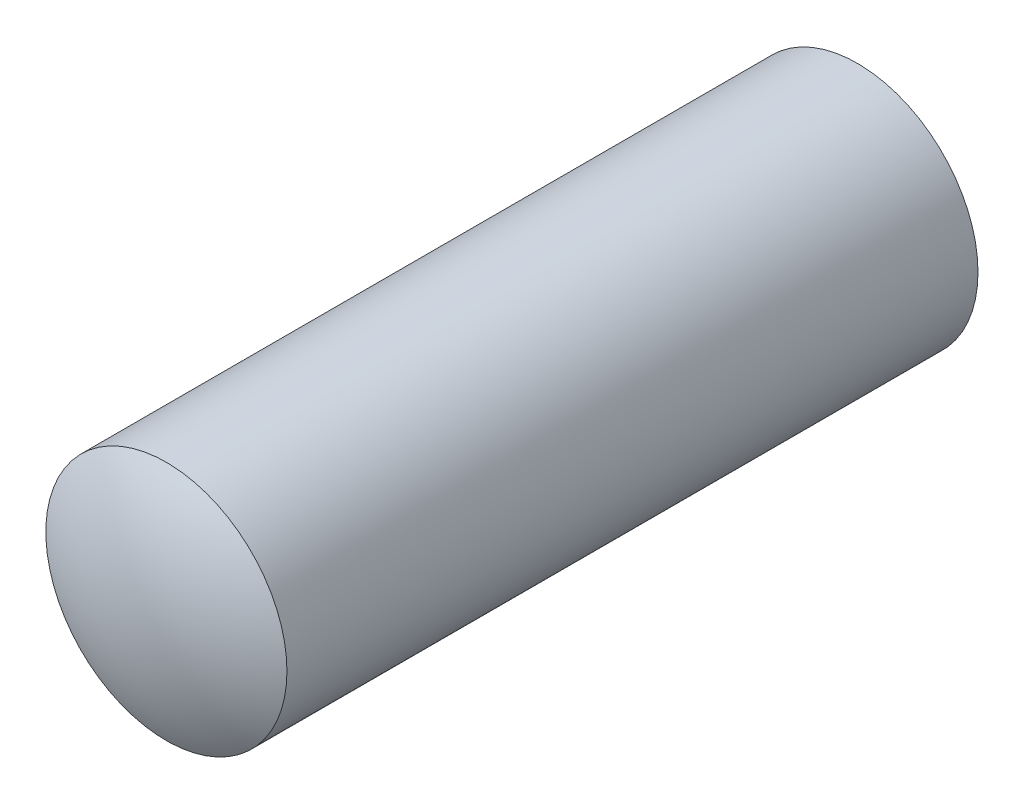
ISO-10303-21;
HEADER;
FILE_DESCRIPTION(('STEP AP214'),'2;1');
FILE_NAME('part.step','',(''),(''),'','','');
FILE_SCHEMA(('AUTOMOTIVE_DESIGN { 1 0 10303 214 1 1 1 1 }'));
ENDSEC;
DATA;
#1=APPLICATION_CONTEXT('core data for automotive mechanical design processes');
#2=APPLICATION_PROTOCOL_DEFINITION('international standard','automotive_design',2000,#1);
#3=PRODUCT_CONTEXT('',#1,'mechanical');
#4=PRODUCT('Part','Part','',(#3));
#5=PRODUCT_RELATED_PRODUCT_CATEGORY('part','',(#4));
#6=PRODUCT_DEFINITION_FORMATION('','',#4);
#7=PRODUCT_DEFINITION_CONTEXT('part definition',#1,'design');
#8=PRODUCT_DEFINITION('design','',#6,#7);
#9=PRODUCT_DEFINITION_SHAPE('','',#8);
#10=(LENGTH_UNIT() NAMED_UNIT(*) SI_UNIT(.MILLI.,.METRE.));
#11=(NAMED_UNIT(*) PLANE_ANGLE_UNIT() SI_UNIT($,.RADIAN.));
#12=(NAMED_UNIT(*) SI_UNIT($,.STERADIAN.) SOLID_ANGLE_UNIT());
#13=UNCERTAINTY_MEASURE_WITH_UNIT(LENGTH_MEASURE(1.E-05),#10,'distance_accuracy_value','');
#14=(GEOMETRIC_REPRESENTATION_CONTEXT(3) GLOBAL_UNCERTAINTY_ASSIGNED_CONTEXT((#13)) GLOBAL_UNIT_ASSIGNED_CONTEXT((#10,
#11,#12)) REPRESENTATION_CONTEXT('',''));
#15=CARTESIAN_POINT('',(0.,0.,0.));
#16=DIRECTION('',(0.,0.,1.));
#17=DIRECTION('',(1.,0.,0.));
#18=AXIS2_PLACEMENT_3D('',#15,#16,#17);
#19=CARTESIAN_POINT('',(0.,0.,6.));
#20=DIRECTION('',(1.,0.,0.));
#21=DIRECTION('',(0.,1.,0.));
#22=AXIS2_PLACEMENT_3D('',#19,#20,#21);
#23=SPHERICAL_SURFACE('',#22,3.);
#24=CARTESIAN_POINT('',(0.,0.,8.59807621135332));
#25=DIRECTION('',(0.,0.,1.));
#26=DIRECTION('',(1.,0.,0.));
#27=AXIS2_PLACEMENT_3D('',#24,#25,#26);
#28=CIRCLE('',#27,1.5);
#29=CARTESIAN_POINT('',(1.5,0.,8.59807621135332));
#30=VERTEX_POINT('',#29);
#31=EDGE_CURVE('E18',#30,#30,#28,.F.);
#32=ORIENTED_EDGE('',*,*,#31,.F.);
#33=EDGE_LOOP('',(#32));
#34=FACE_BOUND('',#33,.T.);
#35=ADVANCED_FACE('F14',(#34),#23,.T.);
#36=CARTESIAN_POINT('',(0.,0.,0.));
#37=DIRECTION('',(0.,0.,1.));
#38=DIRECTION('',(1.,0.,0.));
#39=AXIS2_PLACEMENT_3D('',#36,#37,#38);
#40=PLANE('',#39);
#41=CARTESIAN_POINT('',(0.,0.,0.));
#42=DIRECTION('',(0.,0.,1.));
#43=DIRECTION('',(1.,0.,0.));
#44=AXIS2_PLACEMENT_3D('',#41,#42,#43);
#45=CIRCLE('',#44,1.5);
#46=CARTESIAN_POINT('',(1.5,0.,0.));
#47=VERTEX_POINT('',#46);
#48=EDGE_CURVE('E10',#47,#47,#45,.T.);
#49=ORIENTED_EDGE('',*,*,#48,.F.);
#50=EDGE_LOOP('',(#49));
#51=FACE_BOUND('',#50,.T.);
#52=ADVANCED_FACE('F31',(#51),#40,.F.);
#53=CARTESIAN_POINT('',(0.,0.,0.));
#54=DIRECTION('',(0.,0.,1.));
#55=DIRECTION('',(1.,0.,0.));
#56=AXIS2_PLACEMENT_3D('',#53,#54,#55);
#57=CYLINDRICAL_SURFACE('',#56,1.5);
#58=ORIENTED_EDGE('',*,*,#48,.T.);
#59=EDGE_LOOP('',(#58));
#60=FACE_BOUND('',#59,.T.);
#61=ORIENTED_EDGE('',*,*,#31,.T.);
#62=EDGE_LOOP('',(#61));
#63=FACE_BOUND('',#62,.T.);
#64=ADVANCED_FACE('F28',(#60,#63),#57,.T.);
#65=CLOSED_SHELL('',(#35,#52,#64));
#66=MANIFOLD_SOLID_BREP('B1',#65);
#67=ADVANCED_BREP_SHAPE_REPRESENTATION('',(#18,#66),#14);
#68=SHAPE_DEFINITION_REPRESENTATION(#9,#67);
ENDSEC;
END-ISO-10303-21;
